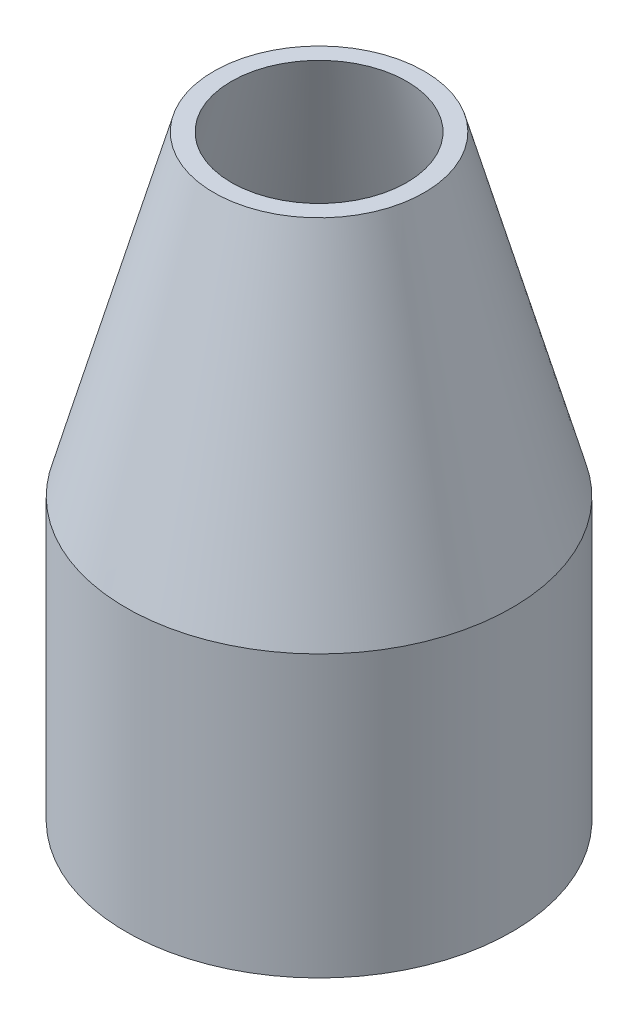
ISO-10303-21;
HEADER;
FILE_DESCRIPTION(('STEP AP214'),'2;1');
FILE_NAME('part.step','',(''),(''),'','','');
FILE_SCHEMA(('AUTOMOTIVE_DESIGN { 1 0 10303 214 1 1 1 1 }'));
ENDSEC;
DATA;
#1=APPLICATION_CONTEXT('core data for automotive mechanical design processes');
#2=APPLICATION_PROTOCOL_DEFINITION('international standard','automotive_design',2000,#1);
#3=PRODUCT_CONTEXT('',#1,'mechanical');
#4=PRODUCT('Part','Part','',(#3));
#5=PRODUCT_RELATED_PRODUCT_CATEGORY('part','',(#4));
#6=PRODUCT_DEFINITION_FORMATION('','',#4);
#7=PRODUCT_DEFINITION_CONTEXT('part definition',#1,'design');
#8=PRODUCT_DEFINITION('design','',#6,#7);
#9=PRODUCT_DEFINITION_SHAPE('','',#8);
#10=(LENGTH_UNIT() NAMED_UNIT(*) SI_UNIT(.MILLI.,.METRE.));
#11=(NAMED_UNIT(*) PLANE_ANGLE_UNIT() SI_UNIT($,.RADIAN.));
#12=(NAMED_UNIT(*) SI_UNIT($,.STERADIAN.) SOLID_ANGLE_UNIT());
#13=UNCERTAINTY_MEASURE_WITH_UNIT(LENGTH_MEASURE(1.E-05),#10,'distance_accuracy_value','');
#14=(GEOMETRIC_REPRESENTATION_CONTEXT(3) GLOBAL_UNCERTAINTY_ASSIGNED_CONTEXT((#13)) GLOBAL_UNIT_ASSIGNED_CONTEXT((#10,
#11,#12)) REPRESENTATION_CONTEXT('',''));
#15=CARTESIAN_POINT('',(0.,0.,0.));
#16=DIRECTION('',(0.,0.,1.));
#17=DIRECTION('',(1.,0.,0.));
#18=AXIS2_PLACEMENT_3D('',#15,#16,#17);
#19=CARTESIAN_POINT('',(5.,0.,0.));
#20=DIRECTION('',(0.,-1.,0.));
#21=DIRECTION('',(0.,0.,-1.));
#22=AXIS2_PLACEMENT_3D('',#19,#20,#21);
#23=PLANE('',#22);
#24=CARTESIAN_POINT('',(0.,0.,0.));
#25=DIRECTION('',(0.,-1.,0.));
#26=DIRECTION('',(0.,0.,-1.));
#27=AXIS2_PLACEMENT_3D('',#24,#25,#26);
#28=CIRCLE('',#27,5.5);
#29=CARTESIAN_POINT('',(0.,0.,-5.5));
#30=VERTEX_POINT('',#29);
#31=EDGE_CURVE('E10',#30,#30,#28,.T.);
#32=ORIENTED_EDGE('',*,*,#31,.T.);
#33=EDGE_LOOP('',(#32));
#34=FACE_BOUND('',#33,.T.);
#35=CARTESIAN_POINT('',(0.,0.,0.));
#36=DIRECTION('',(0.,-1.,0.));
#37=DIRECTION('',(0.,0.,-1.));
#38=AXIS2_PLACEMENT_3D('',#35,#36,#37);
#39=CIRCLE('',#38,5.);
#40=CARTESIAN_POINT('',(0.,0.,-5.));
#41=VERTEX_POINT('',#40);
#42=EDGE_CURVE('E64',#41,#41,#39,.T.);
#43=ORIENTED_EDGE('',*,*,#42,.F.);
#44=EDGE_LOOP('',(#43));
#45=FACE_BOUND('',#44,.T.);
#46=ADVANCED_FACE('F37',(#34,#45),#23,.T.);
#47=CARTESIAN_POINT('',(0.,0.,0.));
#48=DIRECTION('',(0.,-1.,0.));
#49=DIRECTION('',(0.,0.,-1.));
#50=AXIS2_PLACEMENT_3D('',#47,#48,#49);
#51=CYLINDRICAL_SURFACE('',#50,5.5);
#52=CARTESIAN_POINT('',(0.,7.99999999999999,0.));
#53=DIRECTION('',(0.,-1.,0.));
#54=DIRECTION('',(0.,0.,-1.));
#55=AXIS2_PLACEMENT_3D('',#52,#53,#54);
#56=CIRCLE('',#55,5.5);
#57=CARTESIAN_POINT('',(0.,7.99999999999999,-5.5));
#58=VERTEX_POINT('',#57);
#59=EDGE_CURVE('E44',#58,#58,#56,.T.);
#60=ORIENTED_EDGE('',*,*,#59,.T.);
#61=EDGE_LOOP('',(#60));
#62=FACE_BOUND('',#61,.T.);
#63=ORIENTED_EDGE('',*,*,#31,.F.);
#64=EDGE_LOOP('',(#63));
#65=FACE_BOUND('',#64,.T.);
#66=ADVANCED_FACE('F73',(#62,#65),#51,.T.);
#67=CARTESIAN_POINT('',(0.,7.99999999999999,0.));
#68=DIRECTION('',(0.,-1.,0.));
#69=DIRECTION('',(0.,0.,-1.));
#70=AXIS2_PLACEMENT_3D('',#67,#68,#69);
#71=CONICAL_SURFACE('',#70,5.5,0.270946850338421);
#72=CARTESIAN_POINT('',(0.,17.,0.));
#73=DIRECTION('',(0.,-1.,0.));
#74=DIRECTION('',(0.,0.,-1.));
#75=AXIS2_PLACEMENT_3D('',#72,#73,#74);
#76=CIRCLE('',#75,2.99999999999999);
#77=CARTESIAN_POINT('',(0.,17.,-2.99999999999999));
#78=VERTEX_POINT('',#77);
#79=EDGE_CURVE('E49',#78,#78,#76,.T.);
#80=ORIENTED_EDGE('',*,*,#79,.T.);
#81=EDGE_LOOP('',(#80));
#82=FACE_BOUND('',#81,.T.);
#83=ORIENTED_EDGE('',*,*,#59,.F.);
#84=EDGE_LOOP('',(#83));
#85=FACE_BOUND('',#84,.T.);
#86=ADVANCED_FACE('F77',(#82,#85),#71,.T.);
#87=CARTESIAN_POINT('',(2.99999999999999,17.,0.));
#88=DIRECTION('',(0.,1.,0.));
#89=DIRECTION('',(0.,0.,1.));
#90=AXIS2_PLACEMENT_3D('',#87,#88,#89);
#91=PLANE('',#90);
#92=CARTESIAN_POINT('',(0.,17.,0.));
#93=DIRECTION('',(0.,-1.,0.));
#94=DIRECTION('',(0.,0.,-1.));
#95=AXIS2_PLACEMENT_3D('',#92,#93,#94);
#96=CIRCLE('',#95,2.5);
#97=CARTESIAN_POINT('',(0.,17.,-2.5));
#98=VERTEX_POINT('',#97);
#99=EDGE_CURVE('E54',#98,#98,#96,.T.);
#100=ORIENTED_EDGE('',*,*,#99,.T.);
#101=EDGE_LOOP('',(#100));
#102=FACE_BOUND('',#101,.T.);
#103=ORIENTED_EDGE('',*,*,#79,.F.);
#104=EDGE_LOOP('',(#103));
#105=FACE_BOUND('',#104,.T.);
#106=ADVANCED_FACE('F81',(#102,#105),#91,.T.);
#107=CARTESIAN_POINT('',(0.,17.,0.));
#108=DIRECTION('',(0.,-1.,0.));
#109=DIRECTION('',(0.,0.,-1.));
#110=AXIS2_PLACEMENT_3D('',#107,#108,#109);
#111=CONICAL_SURFACE('',#110,2.5,0.27094685033842);
#112=CARTESIAN_POINT('',(0.,7.99999999999999,0.));
#113=DIRECTION('',(0.,-1.,0.));
#114=DIRECTION('',(0.,0.,-1.));
#115=AXIS2_PLACEMENT_3D('',#112,#113,#114);
#116=CIRCLE('',#115,5.);
#117=CARTESIAN_POINT('',(0.,7.99999999999999,-5.));
#118=VERTEX_POINT('',#117);
#119=EDGE_CURVE('E60',#118,#118,#116,.T.);
#120=ORIENTED_EDGE('',*,*,#119,.T.);
#121=EDGE_LOOP('',(#120));
#122=FACE_BOUND('',#121,.T.);
#123=ORIENTED_EDGE('',*,*,#99,.F.);
#124=EDGE_LOOP('',(#123));
#125=FACE_BOUND('',#124,.T.);
#126=ADVANCED_FACE('F88',(#122,#125),#111,.F.);
#127=CARTESIAN_POINT('',(0.,0.,0.));
#128=DIRECTION('',(0.,-1.,0.));
#129=DIRECTION('',(0.,0.,-1.));
#130=AXIS2_PLACEMENT_3D('',#127,#128,#129);
#131=CYLINDRICAL_SURFACE('',#130,5.);
#132=ORIENTED_EDGE('',*,*,#42,.T.);
#133=EDGE_LOOP('',(#132));
#134=FACE_BOUND('',#133,.T.);
#135=ORIENTED_EDGE('',*,*,#119,.F.);
#136=EDGE_LOOP('',(#135));
#137=FACE_BOUND('',#136,.T.);
#138=ADVANCED_FACE('F69',(#134,#137),#131,.F.);
#139=CLOSED_SHELL('',(#46,#66,#86,#106,#126,#138));
#140=MANIFOLD_SOLID_BREP('B2',#139);
#141=ADVANCED_BREP_SHAPE_REPRESENTATION('',(#18,#140),#14);
#142=SHAPE_DEFINITION_REPRESENTATION(#9,#141);
ENDSEC;
END-ISO-10303-21;
